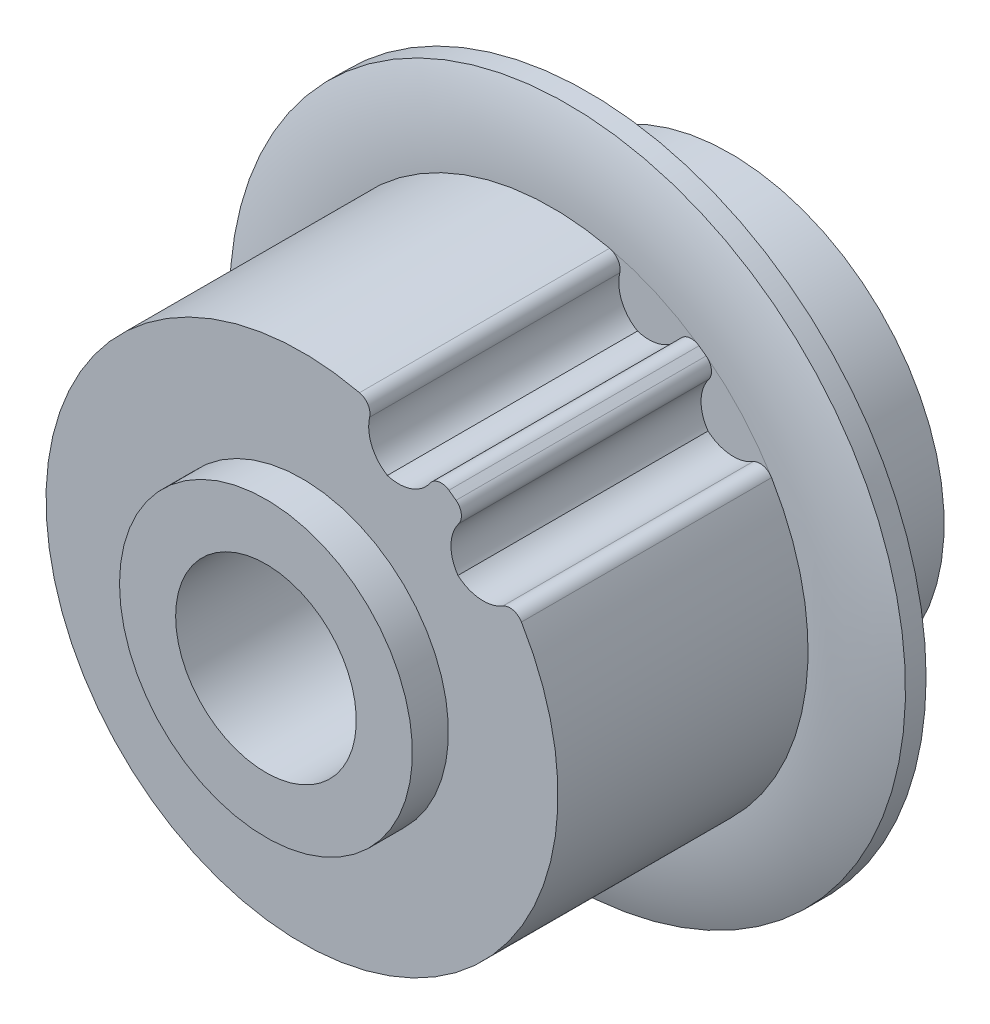
ISO-10303-21;
HEADER;
FILE_DESCRIPTION(('STEP AP214'),'2;1');
FILE_NAME('part.step','',(''),(''),'','','');
FILE_SCHEMA(('AUTOMOTIVE_DESIGN { 1 0 10303 214 1 1 1 1 }'));
ENDSEC;
DATA;
#1=APPLICATION_CONTEXT('core data for automotive mechanical design processes');
#2=APPLICATION_PROTOCOL_DEFINITION('international standard','automotive_design',2000,#1);
#3=PRODUCT_CONTEXT('',#1,'mechanical');
#4=PRODUCT('Part','Part','',(#3));
#5=PRODUCT_RELATED_PRODUCT_CATEGORY('part','',(#4));
#6=PRODUCT_DEFINITION_FORMATION('','',#4);
#7=PRODUCT_DEFINITION_CONTEXT('part definition',#1,'design');
#8=PRODUCT_DEFINITION('design','',#6,#7);
#9=PRODUCT_DEFINITION_SHAPE('','',#8);
#10=(LENGTH_UNIT() NAMED_UNIT(*) SI_UNIT(.MILLI.,.METRE.));
#11=(NAMED_UNIT(*) PLANE_ANGLE_UNIT() SI_UNIT($,.RADIAN.));
#12=(NAMED_UNIT(*) SI_UNIT($,.STERADIAN.) SOLID_ANGLE_UNIT());
#13=UNCERTAINTY_MEASURE_WITH_UNIT(LENGTH_MEASURE(1.E-05),#10,'distance_accuracy_value','');
#14=(GEOMETRIC_REPRESENTATION_CONTEXT(3) GLOBAL_UNCERTAINTY_ASSIGNED_CONTEXT((#13)) GLOBAL_UNIT_ASSIGNED_CONTEXT((#10,
#11,#12)) REPRESENTATION_CONTEXT('',''));
#15=CARTESIAN_POINT('',(0.,0.,0.));
#16=DIRECTION('',(0.,0.,1.));
#17=DIRECTION('',(1.,0.,0.));
#18=AXIS2_PLACEMENT_3D('',#15,#16,#17);
#19=CARTESIAN_POINT('',(-9.69,0.,-9.95));
#20=DIRECTION('',(-1.,0.,0.));
#21=DIRECTION('',(0.,0.,1.));
#22=AXIS2_PLACEMENT_3D('',#19,#20,#21);
#23=CYLINDRICAL_SURFACE('',#22,1.);
#24=CARTESIAN_POINT('',(-9.5,0.,-10.95));
#25=CARTESIAN_POINT('',(-9.49999892870391,0.0559700939608061,-10.9499955022997));
#26=CARTESIAN_POINT('',(-9.49949991902894,0.111986873074257,-10.94528368968));
#27=CARTESIAN_POINT('',(-9.49755527864797,0.222518536683063,-10.9265444379611));
#28=CARTESIAN_POINT('',(-9.49610766287674,0.277030021339668,-10.9124974631074));
#29=CARTESIAN_POINT('',(-9.49242955548284,0.382859598376954,-10.875502986151));
#30=CARTESIAN_POINT('',(-9.49019984820919,0.434180829738746,-10.8525643989129));
#31=CARTESIAN_POINT('',(-9.48520705665351,0.532221152771464,-10.7984545067768));
#32=CARTESIAN_POINT('',(-9.48244420312523,0.578942222297223,-10.7672867614412));
#33=CARTESIAN_POINT('',(-9.47668150333336,0.666671078654715,-10.6974648303014));
#34=CARTESIAN_POINT('',(-9.47368083426394,0.707657540535822,-10.6587839152861));
#35=CARTESIAN_POINT('',(-9.46778735251801,0.78257161431797,-10.5750890419599));
#36=CARTESIAN_POINT('',(-9.46489455023091,0.816498547699888,-10.5300744755932));
#37=CARTESIAN_POINT('',(-9.45953644803475,0.876401748507659,-10.4348614865662));
#38=CARTESIAN_POINT('',(-9.4570721635613,0.902359239575381,-10.3846511887318));
#39=CARTESIAN_POINT('',(-9.45286014633579,0.945466520201204,-10.2805546407822));
#40=CARTESIAN_POINT('',(-9.45111238782538,0.962616626381215,-10.2266685228901));
#41=CARTESIAN_POINT('',(-9.44853861513997,0.987560790152315,-10.1169620532003));
#42=CARTESIAN_POINT('',(-9.44770919717947,0.995389405599358,-10.0611496400934));
#43=CARTESIAN_POINT('',(-9.44705548392416,1.00157520411336,-9.94899729615072));
#44=CARTESIAN_POINT('',(-9.4472311613024,0.999932644686584,-9.89265737969846));
#45=CARTESIAN_POINT('',(-9.44856467676103,0.987251205819851,-9.78128865758294));
#46=CARTESIAN_POINT('',(-9.44971855509934,0.976250208567275,-9.72625548421611));
#47=CARTESIAN_POINT('',(-9.45287229340038,0.945222980929012,-9.61882039299428));
#48=CARTESIAN_POINT('',(-9.45487217354993,0.925196535182412,-9.56641853795969));
#49=CARTESIAN_POINT('',(-9.45949720487386,0.876644469733586,-9.46561314115291));
#50=CARTESIAN_POINT('',(-9.46212360670814,0.848101821073555,-9.41721786096208));
#51=CARTESIAN_POINT('',(-9.46770443570528,0.783342413336238,-9.32589419718302));
#52=CARTESIAN_POINT('',(-9.47065884651236,0.7471260368183,-9.2829655412372));
#53=CARTESIAN_POINT('',(-9.47658007754614,0.667842922786279,-9.20357667259463));
#54=CARTESIAN_POINT('',(-9.47954689086263,0.62474480066102,-9.16714779713866));
#55=CARTESIAN_POINT('',(-9.48514697524511,0.533005846569284,-9.10202007205169));
#56=CARTESIAN_POINT('',(-9.48778009182757,0.484362467099408,-9.07332479578321));
#57=CARTESIAN_POINT('',(-9.49241750088558,0.38287414624455,-9.02448191177889));
#58=CARTESIAN_POINT('',(-9.49442114831984,0.33002496404566,-9.00434306474903));
#59=CARTESIAN_POINT('',(-9.49756499373266,0.221756188152259,-8.97327882580456));
#60=CARTESIAN_POINT('',(-9.49870702191246,0.166342309677429,-8.96233389905823));
#61=CARTESIAN_POINT('',(-9.49978500834582,0.073775403527102,-8.95203987006847));
#62=CARTESIAN_POINT('',(-9.50000070624356,0.0368978464529327,-8.94999703492627));
#63=CARTESIAN_POINT('',(-9.49999892870391,-0.0559700939608068,-8.9500044977003));
#64=CARTESIAN_POINT('',(-9.49949991902894,-0.111986873074257,-8.95471631031997));
#65=CARTESIAN_POINT('',(-9.49755527864797,-0.222518536683064,-8.97345556203892));
#66=CARTESIAN_POINT('',(-9.49610766287674,-0.277030021339668,-8.98750253689262));
#67=CARTESIAN_POINT('',(-9.49242955548284,-0.382859598376955,-9.02449701384902));
#68=CARTESIAN_POINT('',(-9.49019984820919,-0.434180829738747,-9.04743560108709));
#69=CARTESIAN_POINT('',(-9.48520705665351,-0.532221152771464,-9.1015454932232));
#70=CARTESIAN_POINT('',(-9.48244420312523,-0.578942222297223,-9.13271323855881));
#71=CARTESIAN_POINT('',(-9.47668150333336,-0.666671078654715,-9.2025351696986));
#72=CARTESIAN_POINT('',(-9.47368083426394,-0.707657540535822,-9.24121608471389));
#73=CARTESIAN_POINT('',(-9.46778735251801,-0.78257161431797,-9.32491095804006));
#74=CARTESIAN_POINT('',(-9.46489455023091,-0.816498547699888,-9.36992552440684));
#75=CARTESIAN_POINT('',(-9.45953644803475,-0.876401748507659,-9.46513851343379));
#76=CARTESIAN_POINT('',(-9.4570721635613,-0.902359239575381,-9.51534881126819));
#77=CARTESIAN_POINT('',(-9.45286014633579,-0.945466520201204,-9.61944535921782));
#78=CARTESIAN_POINT('',(-9.45111238782538,-0.962616626381215,-9.67333147710991));
#79=CARTESIAN_POINT('',(-9.44853861513997,-0.987560790152315,-9.78303794679972));
#80=CARTESIAN_POINT('',(-9.44770919717947,-0.995389405599358,-9.83885035990659));
#81=CARTESIAN_POINT('',(-9.44705548392416,-1.00157520411336,-9.95100270384928));
#82=CARTESIAN_POINT('',(-9.4472311613024,-0.999932644686584,-10.0073426203015));
#83=CARTESIAN_POINT('',(-9.44856467676103,-0.987251205819851,-10.1187113424171));
#84=CARTESIAN_POINT('',(-9.44971855509934,-0.976250208567275,-10.1737445157839));
#85=CARTESIAN_POINT('',(-9.45287229340038,-0.945222980929012,-10.2811796070057));
#86=CARTESIAN_POINT('',(-9.45487217354993,-0.925196535182412,-10.3335814620403));
#87=CARTESIAN_POINT('',(-9.45949720487386,-0.876644469733586,-10.4343868588471));
#88=CARTESIAN_POINT('',(-9.46212360670814,-0.848101821073556,-10.4827821390379));
#89=CARTESIAN_POINT('',(-9.46770443570528,-0.783342413336238,-10.574105802817));
#90=CARTESIAN_POINT('',(-9.47065884651236,-0.7471260368183,-10.6170344587628));
#91=CARTESIAN_POINT('',(-9.47658007754614,-0.667842922786279,-10.6964233274054));
#92=CARTESIAN_POINT('',(-9.47954689086263,-0.62474480066102,-10.7328522028613));
#93=CARTESIAN_POINT('',(-9.48514697524511,-0.533005846569284,-10.7979799279483));
#94=CARTESIAN_POINT('',(-9.48778009182757,-0.484362467099408,-10.8266752042168));
#95=CARTESIAN_POINT('',(-9.49241750088558,-0.38287414624455,-10.8755180882211));
#96=CARTESIAN_POINT('',(-9.49442114831984,-0.330024964045659,-10.895656935251));
#97=CARTESIAN_POINT('',(-9.49756499373266,-0.221756188152259,-10.9267211741954));
#98=CARTESIAN_POINT('',(-9.49870702191246,-0.166342309677428,-10.9376661009418));
#99=CARTESIAN_POINT('',(-9.49978500834582,-0.0737754035271021,-10.9479601299315));
#100=CARTESIAN_POINT('',(-9.50000070624356,-0.0368978464529331,-10.9500029650737));
#101=CARTESIAN_POINT('',(-9.5,0.,-10.95));
#102=B_SPLINE_CURVE_WITH_KNOTS('',3,(#24,#25,#26,#27,#28,#29,#30,#31,#32,#33,#34,#35,#36,#37,
#38,#39,#40,#41,#42,#43,#44,#45,#46,#47,#48,#49,#50,#51,#52,#53,#54,#55,#56,#57,#58,#59,#60,#61,
#62,#63,#64,#65,#66,#67,#68,#69,#70,#71,#72,#73,#74,#75,#76,#77,#78,#79,#80,#81,#82,#83,#84,#85,
#86,#87,#88,#89,#90,#91,#92,#93,#94,#95,#96,#97,#98,#99,#100,#101),.UNSPECIFIED.,.T.,.F.,(4,2,2,
2,2,2,2,2,2,2,2,2,2,2,2,2,2,2,2,2,2,2,2,2,2,2,2,2,2,2,2,2,2,2,2,2,2,2,4),(0.,0.167792693719711,
0.335937638702718,0.503914433271829,0.671818687359583,0.840331604267453,1.00886071014262,
1.17778388379038,1.34670098429351,1.51498988367949,1.68327420757795,1.85088055416382,
2.01849090030355,2.18643867137875,2.3543780717011,2.52310647594285,2.691912709156,
2.86089136460136,3.02951006699616,3.14012608727887,3.30791878099858,3.47606372598159,
3.6440405205507,3.81194477463845,3.98045769154632,4.14898679742148,4.31790997106925,
4.48682707157238,4.65511597095835,4.82340029485682,4.99100664144269,5.15861698758242,
5.32656475865761,5.49450415897996,5.66323256322172,5.83203879643487,6.00101745188023,
6.16963615427503,6.28025217455774),.UNSPECIFIED.);
#103=CARTESIAN_POINT('',(-9.5,0.,-10.95));
#104=VERTEX_POINT('',#103);
#105=EDGE_CURVE('E132',#104,#104,#102,.T.);
#106=ORIENTED_EDGE('',*,*,#105,.F.);
#107=EDGE_LOOP('',(#106));
#108=FACE_BOUND('',#107,.T.);
#109=CARTESIAN_POINT('',(-4.00899999981644,-3.83635298694221E-05,-8.95000000073588));
#110=CARTESIAN_POINT('',(-4.00899783715485,-0.0552293567423015,-8.95000493874078));
#111=CARTESIAN_POINT('',(-4.00784657338917,-0.110485109786371,-8.95459353594478));
#112=CARTESIAN_POINT('',(-4.0033617579206,-0.219462030811974,-8.97281048034207));
#113=CARTESIAN_POINT('',(-4.00002409504494,-0.273180108443522,-8.98645585799812));
#114=CARTESIAN_POINT('',(-3.99153677468544,-0.377418749122957,-9.02232201321078));
#115=CARTESIAN_POINT('',(-3.98639021795785,-0.427944610423024,-9.04452812246428));
#116=CARTESIAN_POINT('',(-3.97483469983699,-0.524537308783836,-9.09684224257587));
#117=CARTESIAN_POINT('',(-3.96842606598316,-0.570605298153424,-9.12694820390426));
#118=CARTESIAN_POINT('',(-3.95489338257512,-0.657944114077941,-9.19486696509711));
#119=CARTESIAN_POINT('',(-3.94775827540494,-0.699110211696236,-9.23281225529305));
#120=CARTESIAN_POINT('',(-3.93365015110532,-0.774567235090252,-9.31505062775436));
#121=CARTESIAN_POINT('',(-3.92667716125479,-0.808857011108918,-9.35934476946144));
#122=CARTESIAN_POINT('',(-3.91357265682953,-0.870073332175735,-9.45382794149136));
#123=CARTESIAN_POINT('',(-3.90745507532849,-0.896883775390726,-9.50409430330711));
#124=CARTESIAN_POINT('',(-3.89691410697441,-0.941633472202699,-9.60859741479397));
#125=CARTESIAN_POINT('',(-3.89249043743761,-0.959574206141919,-9.66283350018783));
#126=CARTESIAN_POINT('',(-3.88595101723692,-0.985720768263759,-9.77259276027769));
#127=CARTESIAN_POINT('',(-3.88379098499138,-0.994113664108168,-9.82806867268855));
#128=CARTESIAN_POINT('',(-3.88189085459983,-1.00150894116826,-9.93967998462077));
#129=CARTESIAN_POINT('',(-3.88215036764057,-1.0005128311672,-9.99581527673393));
#130=CARTESIAN_POINT('',(-3.88502018325709,-0.989307702476693,-10.1057188666996));
#131=CARTESIAN_POINT('',(-3.88757362908199,-0.979321497188372,-10.1595115976952));
#132=CARTESIAN_POINT('',(-3.89465304460067,-0.95077487458606,-10.2646334163648));
#133=CARTESIAN_POINT('',(-3.89917916731603,-0.932213792107592,-10.3159623125748));
#134=CARTESIAN_POINT('',(-3.90974640949498,-0.886853367969224,-10.4152987641752));
#135=CARTESIAN_POINT('',(-3.9158023542757,-0.859972793070105,-10.463267582164));
#136=CARTESIAN_POINT('',(-3.92873797017951,-0.79879515328098,-10.5540904179203));
#137=CARTESIAN_POINT('',(-3.93561772963354,-0.764497292777454,-10.5969438862251));
#138=CARTESIAN_POINT('',(-3.94966445523883,-0.688310283964731,-10.6775933117669));
#139=CARTESIAN_POINT('',(-3.95683404853103,-0.646234278728623,-10.7152124922289));
#140=CARTESIAN_POINT('',(-3.97048066418085,-0.556265385569994,-10.782909704959));
#141=CARTESIAN_POINT('',(-3.97695738789233,-0.508370008180557,-10.8129844928347));
#142=CARTESIAN_POINT('',(-3.98852136129807,-0.407857220870324,-10.8648028205827));
#143=CARTESIAN_POINT('',(-3.99360272163466,-0.355221004952954,-10.8865111994679));
#144=CARTESIAN_POINT('',(-4.00175264150562,-0.24695561283743,-10.9206813343659));
#145=CARTESIAN_POINT('',(-4.00482539255561,-0.1913329330723,-10.9331623529837));
#146=CARTESIAN_POINT('',(-4.00747866585569,-0.112705807074774,-10.9438863139757));
#147=CARTESIAN_POINT('',(-4.00804790924419,-0.0902269245865095,-10.9461773183999));
#148=CARTESIAN_POINT('',(-4.00880899476839,-0.0451591182652935,-10.9492350749165));
#149=CARTESIAN_POINT('',(-4.00900083601612,-0.0225701941735531,-10.9500018234225));
#150=CARTESIAN_POINT('',(-4.00899795798884,0.0552205504316248,-10.949995545512));
#151=CARTESIAN_POINT('',(-4.00784681650635,0.110476312754407,-10.9454074386454));
#152=CARTESIAN_POINT('',(-4.00336223488077,0.219453343707925,-10.9271914694809));
#153=CARTESIAN_POINT('',(-4.00002468320584,0.273171521890136,-10.9135465753064));
#154=CARTESIAN_POINT('',(-3.99153756179438,0.377410442477614,-10.8776813648257));
#155=CARTESIAN_POINT('',(-3.9863910929306,0.427936483127292,-10.8554757172222));
#156=CARTESIAN_POINT('',(-3.97483571817119,0.524529610929208,-10.80316248862));
#157=CARTESIAN_POINT('',(-3.96842713987295,0.570597850545521,-10.773056957469));
#158=CARTESIAN_POINT('',(-3.95489453074374,0.657937230811791,-10.7051390293912));
#159=CARTESIAN_POINT('',(-3.94775944167969,0.699103644773704,-10.6671941426468));
#160=CARTESIAN_POINT('',(-3.93365131002145,0.774561366551442,-10.5849565274355));
#161=CARTESIAN_POINT('',(-3.92667829470117,0.808851524524785,-10.5406627394299));
#162=CARTESIAN_POINT('',(-3.91357369007897,0.870068700726665,-10.4461801798255));
#163=CARTESIAN_POINT('',(-3.90745603400351,0.896879611395164,-10.3959140714264));
#164=CARTESIAN_POINT('',(-3.89691488088153,0.941630281500125,-10.2914113848947));
#165=CARTESIAN_POINT('',(-3.89249110116544,0.959571521229262,-10.2371754710336));
#166=CARTESIAN_POINT('',(-3.88595143747999,0.985719118813236,-10.1274164171638));
#167=CARTESIAN_POINT('',(-3.88379127405755,0.994112536782719,-10.0719405394734));
#168=CARTESIAN_POINT('',(-3.8818908789198,1.00150884899567,-9.96032920369465));
#169=CARTESIAN_POINT('',(-3.88215025837835,1.00051325207526,-9.90419385303316));
#170=CARTESIAN_POINT('',(-3.88501982318614,0.989309113586772,-9.79429009231826));
#171=CARTESIAN_POINT('',(-3.88757315010191,0.979323391340706,-9.74049725064723));
#172=CARTESIAN_POINT('',(-3.89465235182896,0.950777704978313,-9.63537513312852));
#173=CARTESIAN_POINT('',(-3.89917837965076,0.932217075751482,-9.58404604872254));
#174=CARTESIAN_POINT('',(-3.90974545928263,0.886857544700806,-9.48470920046318));
#175=CARTESIAN_POINT('',(-3.91580133527205,0.859977417312322,-9.43674016947325));
#176=CARTESIAN_POINT('',(-3.92873685166647,0.798800637615128,-9.34591683722279));
#177=CARTESIAN_POINT('',(-3.93561658041334,0.764503189627557,-9.30306308546005));
#178=CARTESIAN_POINT('',(-3.94966328658145,0.688316967604519,-9.22241301352358));
#179=CARTESIAN_POINT('',(-3.95683289233705,0.646241334383191,-9.18479346923408));
#180=CARTESIAN_POINT('',(-3.97047957550749,0.556273128803601,-9.11709546904037));
#181=CARTESIAN_POINT('',(-3.97695635431693,0.508378067139802,-9.08702025725957));
#182=CARTESIAN_POINT('',(-3.98852048194124,0.407865792381285,-9.03520100034339));
#183=CARTESIAN_POINT('',(-3.99360194019151,0.3552297686289,-9.01349212412273));
#184=CARTESIAN_POINT('',(-4.00175208105518,0.246964665784147,-8.97932096755349));
#185=CARTESIAN_POINT('',(-4.00482495480801,0.191342082801663,-8.96683942614396));
#186=CARTESIAN_POINT('',(-4.00747850691793,0.112712049232022,-8.95611432536784));
#187=CARTESIAN_POINT('',(-4.00804785279228,0.0902301817230549,-8.95382290842575));
#188=CARTESIAN_POINT('',(-4.00880904253085,0.0451563756716324,-8.95076473316889));
#189=CARTESIAN_POINT('',(-4.00900088550821,0.0225644368707127,-8.949997978436));
#190=CARTESIAN_POINT('',(-4.00899999981644,-3.83635298694221E-05,-8.95000000073588));
#191=B_SPLINE_CURVE_WITH_KNOTS('',3,(#109,#110,#111,#112,#113,#114,#115,#116,#117,#118,#119,
#120,#121,#122,#123,#124,#125,#126,#127,#128,#129,#130,#131,#132,#133,#134,#135,#136,#137,#138,
#139,#140,#141,#142,#143,#144,#145,#146,#147,#148,#149,#150,#151,#152,#153,#154,#155,#156,#157,
#158,#159,#160,#161,#162,#163,#164,#165,#166,#167,#168,#169,#170,#171,#172,#173,#174,#175,#176,
#177,#178,#179,#180,#181,#182,#183,#184,#185,#186,#187,#188,#189,#190),.UNSPECIFIED.,.T.,.F.,(4,
2,2,2,2,2,2,2,2,2,2,2,2,2,2,2,2,2,2,2,2,2,2,2,2,2,2,2,2,2,2,2,2,2,2,2,2,2,2,2,4),(0.,
0.165486316353608,0.331284699839844,0.49680025134277,0.662272904040501,0.830812262673603,
0.999379778518091,1.17043434970166,1.34146036246759,1.50907446792837,1.67666163879701,
1.840206271743,2.00376359319152,2.16897118456502,2.33419650569204,2.50408286455722,
2.67404215662728,2.84470813341029,3.0150168220486,3.08278055286827,3.1505444431271,
3.31603065138589,3.48182895228629,3.64734441436066,3.8128169711717,3.98135620285448,
4.14992359408572,4.3209781795018,4.49200420733051,4.6596184578163,4.82720577276853,
4.99075044947191,5.15430781360733,5.31951528470037,5.48474048690697,5.65462674838026,
5.82458593755983,5.99525197459394,6.1655607510437,6.2333335011333,6.30110641044064),.UNSPECIFIED.);
#192=CARTESIAN_POINT('',(-4.00899999981644,-3.83635298694221E-05,-8.95000000073588));
#193=VERTEX_POINT('',#192);
#194=EDGE_CURVE('E101',#193,#193,#191,.T.);
#195=ORIENTED_EDGE('',*,*,#194,.T.);
#196=EDGE_LOOP('',(#195));
#197=FACE_BOUND('',#196,.T.);
#198=ADVANCED_FACE('F16',(#108,#197),#23,.F.);
#199=CARTESIAN_POINT('',(0.,0.,-13.45));
#200=DIRECTION('',(0.,0.,-1.));
#201=DIRECTION('',(-1.,0.,0.));
#202=AXIS2_PLACEMENT_3D('',#199,#200,#201);
#203=PLANE('',#202);
#204=CARTESIAN_POINT('',(0.,0.,-13.45));
#205=DIRECTION('',(0.,0.,-1.));
#206=DIRECTION('',(-1.,0.,0.));
#207=AXIS2_PLACEMENT_3D('',#204,#205,#206);
#208=CIRCLE('',#207,4.009);
#209=CARTESIAN_POINT('',(-4.009,0.,-13.45));
#210=VERTEX_POINT('',#209);
#211=EDGE_CURVE('E138',#210,#210,#208,.F.);
#212=ORIENTED_EDGE('',*,*,#211,.T.);
#213=EDGE_LOOP('',(#212));
#214=FACE_BOUND('',#213,.T.);
#215=CARTESIAN_POINT('',(0.,0.,-13.45));
#216=DIRECTION('',(0.,0.,-1.));
#217=DIRECTION('',(-1.,0.,0.));
#218=AXIS2_PLACEMENT_3D('',#215,#216,#217);
#219=CIRCLE('',#218,9.5);
#220=CARTESIAN_POINT('',(-9.5,0.,-13.45));
#221=VERTEX_POINT('',#220);
#222=EDGE_CURVE('E129',#221,#221,#219,.F.);
#223=ORIENTED_EDGE('',*,*,#222,.F.);
#224=EDGE_LOOP('',(#223));
#225=FACE_BOUND('',#224,.T.);
#226=ADVANCED_FACE('F160',(#214,#225),#203,.T.);
#227=CARTESIAN_POINT('',(0.,0.,8.18));
#228=DIRECTION('',(0.,0.,-1.));
#229=DIRECTION('',(-1.,0.,0.));
#230=AXIS2_PLACEMENT_3D('',#227,#228,#229);
#231=CYLINDRICAL_SURFACE('',#230,11.3625);
#232=CARTESIAN_POINT('',(0.,0.,5.55));
#233=DIRECTION('',(0.,0.,-1.));
#234=DIRECTION('',(-1.,0.,0.));
#235=AXIS2_PLACEMENT_3D('',#232,#233,#234);
#236=CIRCLE('',#235,11.3625);
#237=CARTESIAN_POINT('',(6.51940660981192,9.30611324377365,5.55));
#238=VERTEX_POINT('',#237);
#239=CARTESIAN_POINT('',(6.83603220620295,9.07607128254069,5.55));
#240=VERTEX_POINT('',#239);
#241=EDGE_CURVE('E20',#238,#240,#236,.T.);
#242=ORIENTED_EDGE('',*,*,#241,.T.);
#243=DIRECTION('',(0.,0.,1.));
#244=VECTOR('',#243,1.);
#245=CARTESIAN_POINT('',(6.83603220620619,9.07607128253825,5.55));
#246=LINE('',#245,#244);
#247=CARTESIAN_POINT('',(6.83603220620493,9.07607128253897,-5.55));
#248=VERTEX_POINT('',#247);
#249=EDGE_CURVE('E116',#248,#240,#246,.T.);
#250=ORIENTED_EDGE('',*,*,#249,.F.);
#251=CARTESIAN_POINT('',(0.,0.,-5.55));
#252=DIRECTION('',(0.,0.,-1.));
#253=DIRECTION('',(-1.,0.,0.));
#254=AXIS2_PLACEMENT_3D('',#251,#252,#253);
#255=CIRCLE('',#254,11.3625);
#256=CARTESIAN_POINT('',(6.51940661070273,9.30611324314981,-5.55));
#257=VERTEX_POINT('',#256);
#258=EDGE_CURVE('E102',#248,#257,#255,.F.);
#259=ORIENTED_EDGE('',*,*,#258,.T.);
#260=DIRECTION('',(0.,0.,1.));
#261=VECTOR('',#260,1.);
#262=CARTESIAN_POINT('',(6.51940660981177,9.30611324377368,5.55));
#263=LINE('',#262,#261);
#264=EDGE_CURVE('E105',#238,#257,#263,.F.);
#265=ORIENTED_EDGE('',*,*,#264,.F.);
#266=EDGE_LOOP('',(#242,#250,#259,#265));
#267=FACE_BOUND('',#266,.T.);
#268=ADVANCED_FACE('F106',(#267),#231,.T.);
#269=CARTESIAN_POINT('',(0.,0.,8.18));
#270=DIRECTION('',(0.,0.,-1.));
#271=DIRECTION('',(-1.,0.,0.));
#272=AXIS2_PLACEMENT_3D('',#269,#270,#271);
#273=CYLINDRICAL_SURFACE('',#272,4.009);
#274=ORIENTED_EDGE('',*,*,#211,.F.);
#275=EDGE_LOOP('',(#274));
#276=FACE_BOUND('',#275,.T.);
#277=CARTESIAN_POINT('',(0.,0.,7.15));
#278=DIRECTION('',(0.,0.,-1.));
#279=DIRECTION('',(-1.,0.,0.));
#280=AXIS2_PLACEMENT_3D('',#277,#278,#279);
#281=CIRCLE('',#280,4.009);
#282=CARTESIAN_POINT('',(-4.009,0.,7.15));
#283=VERTEX_POINT('',#282);
#284=EDGE_CURVE('E108',#283,#283,#281,.F.);
#285=ORIENTED_EDGE('',*,*,#284,.T.);
#286=EDGE_LOOP('',(#285));
#287=FACE_BOUND('',#286,.T.);
#288=ORIENTED_EDGE('',*,*,#194,.F.);
#289=EDGE_LOOP('',(#288));
#290=FACE_BOUND('',#289,.T.);
#291=ADVANCED_FACE('F145',(#276,#287,#290),#273,.F.);
#292=CARTESIAN_POINT('',(0.,0.,8.18));
#293=DIRECTION('',(0.,0.,-1.));
#294=DIRECTION('',(-1.,0.,0.));
#295=AXIS2_PLACEMENT_3D('',#292,#293,#294);
#296=CYLINDRICAL_SURFACE('',#295,9.5);
#297=CARTESIAN_POINT('',(0.,0.,-7.15));
#298=DIRECTION('',(0.,0.,-1.));
#299=DIRECTION('',(-1.,0.,0.));
#300=AXIS2_PLACEMENT_3D('',#297,#298,#299);
#301=CIRCLE('',#300,9.5);
#302=CARTESIAN_POINT('',(-9.5,0.,-7.15));
#303=VERTEX_POINT('',#302);
#304=EDGE_CURVE('E167',#303,#303,#301,.F.);
#305=ORIENTED_EDGE('',*,*,#304,.F.);
#306=EDGE_LOOP('',(#305));
#307=FACE_BOUND('',#306,.T.);
#308=ORIENTED_EDGE('',*,*,#222,.T.);
#309=EDGE_LOOP('',(#308));
#310=FACE_BOUND('',#309,.T.);
#311=ORIENTED_EDGE('',*,*,#105,.T.);
#312=EDGE_LOOP('',(#311));
#313=FACE_BOUND('',#312,.T.);
#314=ADVANCED_FACE('F139',(#307,#310,#313),#296,.T.);
#315=CARTESIAN_POINT('',(6.475390521211,8.5972541059,5.55));
#316=DIRECTION('',(0.,0.,1.));
#317=DIRECTION('',(1.,0.,0.));
#318=AXIS2_PLACEMENT_3D('',#315,#316,#317);
#319=CYLINDRICAL_SURFACE('',#318,0.59944);
#320=CARTESIAN_POINT('',(6.475390521211,8.5972541059,-5.55));
#321=DIRECTION('',(0.,0.,1.));
#322=DIRECTION('',(1.,0.,0.));
#323=AXIS2_PLACEMENT_3D('',#320,#321,#322);
#324=CIRCLE('',#323,0.59944);
#325=CARTESIAN_POINT('',(6.95386365701467,8.23615609716265,-5.55));
#326=VERTEX_POINT('',#325);
#327=EDGE_CURVE('E123',#326,#248,#324,.T.);
#328=ORIENTED_EDGE('',*,*,#327,.T.);
#329=ORIENTED_EDGE('',*,*,#249,.T.);
#330=CARTESIAN_POINT('',(6.475390521211,8.5972541059,5.55));
#331=DIRECTION('',(0.,0.,1.));
#332=DIRECTION('',(1.,0.,0.));
#333=AXIS2_PLACEMENT_3D('',#330,#331,#332);
#334=CIRCLE('',#333,0.59944);
#335=CARTESIAN_POINT('',(6.95386365701467,8.23615609716265,5.55));
#336=VERTEX_POINT('',#335);
#337=EDGE_CURVE('E97',#240,#336,#334,.F.);
#338=ORIENTED_EDGE('',*,*,#337,.T.);
#339=DIRECTION('',(0.,0.,1.));
#340=VECTOR('',#339,1.);
#341=CARTESIAN_POINT('',(6.95386365701451,8.23615609716262,5.55));
#342=LINE('',#341,#340);
#343=EDGE_CURVE('E169',#336,#326,#342,.F.);
#344=ORIENTED_EDGE('',*,*,#343,.T.);
#345=EDGE_LOOP('',(#328,#329,#338,#344));
#346=FACE_BOUND('',#345,.T.);
#347=ADVANCED_FACE('F144',(#346),#319,.T.);
#348=CARTESIAN_POINT('',(6.175468823393,8.815159974436,5.55));
#349=DIRECTION('',(0.,0.,1.));
#350=DIRECTION('',(1.,0.,0.));
#351=AXIS2_PLACEMENT_3D('',#348,#349,#350);
#352=CYLINDRICAL_SURFACE('',#351,0.59944);
#353=CARTESIAN_POINT('',(6.175468823393,8.815159974436,5.55));
#354=DIRECTION('',(0.,0.,1.));
#355=DIRECTION('',(1.,0.,0.));
#356=AXIS2_PLACEMENT_3D('',#353,#354,#355);
#357=CIRCLE('',#356,0.59944);
#358=CARTESIAN_POINT('',(5.68418787884729,9.15862954677945,5.55));
#359=VERTEX_POINT('',#358);
#360=EDGE_CURVE('E94',#359,#238,#357,.F.);
#361=ORIENTED_EDGE('',*,*,#360,.T.);
#362=ORIENTED_EDGE('',*,*,#264,.T.);
#363=CARTESIAN_POINT('',(6.175468823393,8.815159974436,-5.55));
#364=DIRECTION('',(0.,0.,1.));
#365=DIRECTION('',(1.,0.,0.));
#366=AXIS2_PLACEMENT_3D('',#363,#364,#365);
#367=CIRCLE('',#366,0.59944);
#368=CARTESIAN_POINT('',(5.68418787884729,9.15862954677945,-5.55));
#369=VERTEX_POINT('',#368);
#370=EDGE_CURVE('E114',#257,#369,#367,.T.);
#371=ORIENTED_EDGE('',*,*,#370,.T.);
#372=DIRECTION('',(0.,0.,1.));
#373=VECTOR('',#372,1.);
#374=CARTESIAN_POINT('',(5.68418787884778,9.15862954677946,5.55));
#375=LINE('',#374,#373);
#376=EDGE_CURVE('E112',#369,#359,#375,.T.);
#377=ORIENTED_EDGE('',*,*,#376,.T.);
#378=EDGE_LOOP('',(#361,#362,#371,#377));
#379=FACE_BOUND('',#378,.T.);
#380=ADVANCED_FACE('F110',(#379),#352,.T.);
#381=CARTESIAN_POINT('',(0.,0.,7.15));
#382=DIRECTION('',(0.,0.,-1.));
#383=DIRECTION('',(-1.,0.,0.));
#384=AXIS2_PLACEMENT_3D('',#381,#382,#383);
#385=PLANE('',#384);
#386=ORIENTED_EDGE('',*,*,#284,.F.);
#387=EDGE_LOOP('',(#386));
#388=FACE_BOUND('',#387,.T.);
#389=CARTESIAN_POINT('',(0.,0.,7.15));
#390=DIRECTION('',(0.,0.,-1.));
#391=DIRECTION('',(-1.,0.,0.));
#392=AXIS2_PLACEMENT_3D('',#389,#390,#391);
#393=CIRCLE('',#392,6.5);
#394=CARTESIAN_POINT('',(-6.5,0.,7.15));
#395=VERTEX_POINT('',#394);
#396=EDGE_CURVE('E175',#395,#395,#393,.T.);
#397=ORIENTED_EDGE('',*,*,#396,.F.);
#398=EDGE_LOOP('',(#397));
#399=FACE_BOUND('',#398,.T.);
#400=ADVANCED_FACE('F347',(#388,#399),#385,.F.);
#401=CARTESIAN_POINT('',(0.,0.,-7.15));
#402=DIRECTION('',(0.,0.,-1.));
#403=DIRECTION('',(-1.,0.,0.));
#404=AXIS2_PLACEMENT_3D('',#401,#402,#403);
#405=PLANE('',#404);
#406=ORIENTED_EDGE('',*,*,#304,.T.);
#407=EDGE_LOOP('',(#406));
#408=FACE_BOUND('',#407,.T.);
#409=CARTESIAN_POINT('',(0.,0.,-7.15));
#410=DIRECTION('',(0.,0.,-1.));
#411=DIRECTION('',(-1.,0.,0.));
#412=AXIS2_PLACEMENT_3D('',#409,#410,#411);
#413=CIRCLE('',#412,15.);
#414=CARTESIAN_POINT('',(-15.,0.,-7.15));
#415=VERTEX_POINT('',#414);
#416=EDGE_CURVE('E179',#415,#415,#413,.F.);
#417=ORIENTED_EDGE('',*,*,#416,.F.);
#418=EDGE_LOOP('',(#417));
#419=FACE_BOUND('',#418,.T.);
#420=ADVANCED_FACE('F419',(#408,#419),#405,.T.);
#421=CARTESIAN_POINT('',(8.310213351306,7.212535046971,5.55));
#422=DIRECTION('',(0.,0.,1.));
#423=DIRECTION('',(1.,0.,0.));
#424=AXIS2_PLACEMENT_3D('',#421,#422,#423);
#425=CYLINDRICAL_SURFACE('',#424,1.69926);
#426=CARTESIAN_POINT('',(8.310213351306,7.212535046971,-5.55));
#427=DIRECTION('',(0.,0.,1.));
#428=DIRECTION('',(1.,0.,0.));
#429=AXIS2_PLACEMENT_3D('',#426,#427,#428);
#430=CIRCLE('',#429,1.69926);
#431=CARTESIAN_POINT('',(6.92198474820684,6.23258306185219,-5.55));
#432=VERTEX_POINT('',#431);
#433=EDGE_CURVE('E188',#326,#432,#430,.T.);
#434=ORIENTED_EDGE('',*,*,#433,.F.);
#435=ORIENTED_EDGE('',*,*,#343,.F.);
#436=CARTESIAN_POINT('',(8.310213351306,7.212535046971,5.55));
#437=DIRECTION('',(0.,0.,1.));
#438=DIRECTION('',(1.,0.,0.));
#439=AXIS2_PLACEMENT_3D('',#436,#437,#438);
#440=CIRCLE('',#439,1.69926);
#441=CARTESIAN_POINT('',(6.92198474820684,6.23258306185219,5.55));
#442=VERTEX_POINT('',#441);
#443=EDGE_CURVE('E199',#336,#442,#440,.T.);
#444=ORIENTED_EDGE('',*,*,#443,.T.);
#445=DIRECTION('',(0.,0.,1.));
#446=VECTOR('',#445,1.);
#447=CARTESIAN_POINT('',(6.92198474820597,6.23258306185296,5.55));
#448=LINE('',#447,#446);
#449=EDGE_CURVE('E195',#442,#432,#448,.F.);
#450=ORIENTED_EDGE('',*,*,#449,.T.);
#451=EDGE_LOOP('',(#434,#435,#444,#450));
#452=FACE_BOUND('',#451,.T.);
#453=ADVANCED_FACE('F340',(#452),#425,.F.);
#454=CARTESIAN_POINT('',(4.291531302994,10.1322784616,5.55));
#455=DIRECTION('',(0.,0.,1.));
#456=DIRECTION('',(1.,0.,0.));
#457=AXIS2_PLACEMENT_3D('',#454,#455,#456);
#458=CYLINDRICAL_SURFACE('',#457,1.69926);
#459=CARTESIAN_POINT('',(4.291531302994,10.1322784616,-5.55));
#460=DIRECTION('',(0.,0.,1.));
#461=DIRECTION('',(1.,0.,0.));
#462=AXIS2_PLACEMENT_3D('',#459,#460,#461);
#463=CIRCLE('',#462,1.69926);
#464=CARTESIAN_POINT('',(3.78852781232821,8.50917278544206,-5.55));
#465=VERTEX_POINT('',#464);
#466=EDGE_CURVE('E185',#465,#369,#463,.T.);
#467=ORIENTED_EDGE('',*,*,#466,.F.);
#468=DIRECTION('',(0.,0.,1.));
#469=VECTOR('',#468,1.);
#470=CARTESIAN_POINT('',(3.78852781232616,8.50917278544328,5.55));
#471=LINE('',#470,#469);
#472=CARTESIAN_POINT('',(3.78852781232821,8.50917278544206,5.55));
#473=VERTEX_POINT('',#472);
#474=EDGE_CURVE('E178',#465,#473,#471,.T.);
#475=ORIENTED_EDGE('',*,*,#474,.T.);
#476=CARTESIAN_POINT('',(4.291531302994,10.1322784616,5.55));
#477=DIRECTION('',(0.,0.,1.));
#478=DIRECTION('',(1.,0.,0.));
#479=AXIS2_PLACEMENT_3D('',#476,#477,#478);
#480=CIRCLE('',#479,1.69926);
#481=EDGE_CURVE('E206',#473,#359,#480,.T.);
#482=ORIENTED_EDGE('',*,*,#481,.T.);
#483=ORIENTED_EDGE('',*,*,#376,.F.);
#484=EDGE_LOOP('',(#467,#475,#482,#483));
#485=FACE_BOUND('',#484,.T.);
#486=ADVANCED_FACE('F404',(#485),#458,.F.);
#487=CARTESIAN_POINT('',(0.,0.,8.18));
#488=DIRECTION('',(0.,0.,-1.));
#489=DIRECTION('',(-1.,0.,0.));
#490=AXIS2_PLACEMENT_3D('',#487,#488,#489);
#491=CYLINDRICAL_SURFACE('',#490,6.5);
#492=ORIENTED_EDGE('',*,*,#396,.T.);
#493=EDGE_LOOP('',(#492));
#494=FACE_BOUND('',#493,.T.);
#495=CARTESIAN_POINT('',(0.,0.,5.55));
#496=DIRECTION('',(0.,0.,-1.));
#497=DIRECTION('',(-1.,0.,0.));
#498=AXIS2_PLACEMENT_3D('',#495,#496,#497);
#499=CIRCLE('',#498,6.5);
#500=CARTESIAN_POINT('',(-6.5,0.,5.55));
#501=VERTEX_POINT('',#500);
#502=EDGE_CURVE('E208',#501,#501,#499,.F.);
#503=ORIENTED_EDGE('',*,*,#502,.T.);
#504=EDGE_LOOP('',(#503));
#505=FACE_BOUND('',#504,.T.);
#506=ADVANCED_FACE('F397',(#494,#505),#491,.T.);
#507=CARTESIAN_POINT('',(4.658155366055,9.969046912002,5.55));
#508=DIRECTION('',(0.,0.,1.));
#509=DIRECTION('',(1.,0.,0.));
#510=AXIS2_PLACEMENT_3D('',#507,#508,#509);
#511=CYLINDRICAL_SURFACE('',#510,1.69926);
#512=CARTESIAN_POINT('',(4.658155366055,9.969046912002,-5.55));
#513=DIRECTION('',(0.,0.,1.));
#514=DIRECTION('',(1.,0.,0.));
#515=AXIS2_PLACEMENT_3D('',#512,#513,#514);
#516=CIRCLE('',#515,1.69926);
#517=CARTESIAN_POINT('',(3.00272407412359,10.352494151261,-5.55));
#518=VERTEX_POINT('',#517);
#519=EDGE_CURVE('E182',#518,#465,#516,.T.);
#520=ORIENTED_EDGE('',*,*,#519,.F.);
#521=DIRECTION('',(0.,0.,1.));
#522=VECTOR('',#521,1.);
#523=CARTESIAN_POINT('',(3.00272407412306,10.35249415126,5.55));
#524=LINE('',#523,#522);
#525=CARTESIAN_POINT('',(3.00272407412359,10.352494151261,5.55));
#526=VERTEX_POINT('',#525);
#527=EDGE_CURVE('E214',#526,#518,#524,.F.);
#528=ORIENTED_EDGE('',*,*,#527,.F.);
#529=CARTESIAN_POINT('',(4.658155366055,9.969046912002,5.55));
#530=DIRECTION('',(0.,0.,1.));
#531=DIRECTION('',(1.,0.,0.));
#532=AXIS2_PLACEMENT_3D('',#529,#530,#531);
#533=CIRCLE('',#532,1.69926);
#534=EDGE_CURVE('E203',#526,#473,#533,.T.);
#535=ORIENTED_EDGE('',*,*,#534,.T.);
#536=ORIENTED_EDGE('',*,*,#474,.F.);
#537=EDGE_LOOP('',(#520,#528,#535,#536));
#538=FACE_BOUND('',#537,.T.);
#539=ADVANCED_FACE('F390',(#538),#511,.F.);
#540=CARTESIAN_POINT('',(0.,0.,8.18));
#541=DIRECTION('',(0.,0.,-1.));
#542=DIRECTION('',(-1.,0.,0.));
#543=AXIS2_PLACEMENT_3D('',#540,#541,#542);
#544=CYLINDRICAL_SURFACE('',#543,15.);
#545=ORIENTED_EDGE('',*,*,#416,.T.);
#546=EDGE_LOOP('',(#545));
#547=FACE_BOUND('',#546,.T.);
#548=CARTESIAN_POINT('',(0.,0.,-6.23503388358285));
#549=DIRECTION('',(0.,0.,1.));
#550=DIRECTION('',(0.,-1.,0.));
#551=AXIS2_PLACEMENT_3D('',#548,#549,#550);
#552=CIRCLE('',#551,15.0000000000001);
#553=CARTESIAN_POINT('',(0.,-15.0000000000001,-6.23503388358285));
#554=VERTEX_POINT('',#553);
#555=EDGE_CURVE('E220',#554,#554,#552,.T.);
#556=ORIENTED_EDGE('',*,*,#555,.F.);
#557=EDGE_LOOP('',(#556));
#558=FACE_BOUND('',#557,.T.);
#559=ADVANCED_FACE('F305',(#547,#558),#544,.T.);
#560=CARTESIAN_POINT('',(0.,0.,-5.55));
#561=DIRECTION('',(0.,0.,1.));
#562=DIRECTION('',(1.,0.,0.));
#563=AXIS2_PLACEMENT_3D('',#560,#561,#562);
#564=PLANE('',#563);
#565=ORIENTED_EDGE('',*,*,#370,.F.);
#566=CARTESIAN_POINT('',(0.,0.,-5.55));
#567=DIRECTION('',(0.,0.,-1.));
#568=DIRECTION('',(0.224726548130403,0.974421868887082,0.));
#569=AXIS2_PLACEMENT_3D('',#566,#567,#568);
#570=CIRCLE('',#569,11.3625000000008);
#571=CARTESIAN_POINT('',(2.55345540320718,11.0718684852114,-5.55));
#572=VERTEX_POINT('',#571);
#573=EDGE_CURVE('E238',#572,#257,#570,.T.);
#574=ORIENTED_EDGE('',*,*,#573,.F.);
#575=CARTESIAN_POINT('',(2.418745322411,10.48776103985,-5.55));
#576=DIRECTION('',(0.,0.,1.));
#577=DIRECTION('',(1.,0.,0.));
#578=AXIS2_PLACEMENT_3D('',#575,#576,#577);
#579=CIRCLE('',#578,0.59944);
#580=EDGE_CURVE('E217',#518,#572,#579,.T.);
#581=ORIENTED_EDGE('',*,*,#580,.F.);
#582=ORIENTED_EDGE('',*,*,#519,.T.);
#583=ORIENTED_EDGE('',*,*,#466,.T.);
#584=EDGE_LOOP('',(#565,#574,#581,#582,#583));
#585=FACE_BOUND('',#584,.T.);
#586=ADVANCED_FACE('F301',(#585),#564,.T.);
#587=CARTESIAN_POINT('',(0.,0.,-5.55));
#588=DIRECTION('',(0.,0.,1.));
#589=DIRECTION('',(1.,0.,0.));
#590=AXIS2_PLACEMENT_3D('',#587,#588,#589);
#591=PLANE('',#590);
#592=CARTESIAN_POINT('',(9.227020068602,5.541259894393,-5.55));
#593=DIRECTION('',(0.,0.,1.));
#594=DIRECTION('',(1.,0.,0.));
#595=AXIS2_PLACEMENT_3D('',#592,#593,#594);
#596=CIRCLE('',#595,0.59944);
#597=CARTESIAN_POINT('',(8.91791425413962,6.05485692423795,-5.55));
#598=VERTEX_POINT('',#597);
#599=CARTESIAN_POINT('',(9.74091155646612,5.84987592168442,-5.55));
#600=VERTEX_POINT('',#599);
#601=EDGE_CURVE('E191',#598,#600,#596,.F.);
#602=ORIENTED_EDGE('',*,*,#601,.T.);
#603=CARTESIAN_POINT('',(0.,0.,-5.55));
#604=DIRECTION('',(0.,0.,-1.));
#605=DIRECTION('',(0.60163099724586,0.798774150278382,0.));
#606=AXIS2_PLACEMENT_3D('',#603,#604,#605);
#607=CIRCLE('',#606,11.3624999999999);
#608=EDGE_CURVE('E281',#248,#600,#607,.T.);
#609=ORIENTED_EDGE('',*,*,#608,.F.);
#610=ORIENTED_EDGE('',*,*,#327,.F.);
#611=ORIENTED_EDGE('',*,*,#433,.T.);
#612=CARTESIAN_POINT('',(8.041677856362,7.510773928331,-5.55));
#613=DIRECTION('',(0.,0.,1.));
#614=DIRECTION('',(1.,0.,0.));
#615=AXIS2_PLACEMENT_3D('',#612,#613,#614);
#616=CIRCLE('',#615,1.69926);
#617=EDGE_CURVE('E196',#432,#598,#616,.T.);
#618=ORIENTED_EDGE('',*,*,#617,.T.);
#619=EDGE_LOOP('',(#602,#609,#610,#611,#618));
#620=FACE_BOUND('',#619,.T.);
#621=ADVANCED_FACE('F290',(#620),#591,.T.);
#622=CARTESIAN_POINT('',(8.041677856362,7.510773928331,5.55));
#623=DIRECTION('',(0.,0.,1.));
#624=DIRECTION('',(1.,0.,0.));
#625=AXIS2_PLACEMENT_3D('',#622,#623,#624);
#626=CYLINDRICAL_SURFACE('',#625,1.69926);
#627=ORIENTED_EDGE('',*,*,#617,.F.);
#628=ORIENTED_EDGE('',*,*,#449,.F.);
#629=CARTESIAN_POINT('',(8.041677856362,7.510773928331,5.55));
#630=DIRECTION('',(0.,0.,1.));
#631=DIRECTION('',(1.,0.,0.));
#632=AXIS2_PLACEMENT_3D('',#629,#630,#631);
#633=CIRCLE('',#632,1.69926);
#634=CARTESIAN_POINT('',(8.9179142541398,6.05485692423764,5.55));
#635=VERTEX_POINT('',#634);
#636=EDGE_CURVE('E201',#442,#635,#633,.T.);
#637=ORIENTED_EDGE('',*,*,#636,.T.);
#638=DIRECTION('',(0.,0.,1.));
#639=VECTOR('',#638,1.);
#640=CARTESIAN_POINT('',(8.91791425413992,6.05485692423813,5.55));
#641=LINE('',#640,#639);
#642=EDGE_CURVE('E225',#598,#635,#641,.T.);
#643=ORIENTED_EDGE('',*,*,#642,.F.);
#644=EDGE_LOOP('',(#627,#628,#637,#643));
#645=FACE_BOUND('',#644,.T.);
#646=ADVANCED_FACE('F300',(#645),#626,.F.);
#647=CARTESIAN_POINT('',(0.,0.,5.55));
#648=DIRECTION('',(0.,0.,-1.));
#649=DIRECTION('',(-1.,0.,0.));
#650=AXIS2_PLACEMENT_3D('',#647,#648,#649);
#651=PLANE('',#650);
#652=ORIENTED_EDGE('',*,*,#502,.F.);
#653=EDGE_LOOP('',(#652));
#654=FACE_BOUND('',#653,.T.);
#655=ORIENTED_EDGE('',*,*,#360,.F.);
#656=ORIENTED_EDGE('',*,*,#481,.F.);
#657=ORIENTED_EDGE('',*,*,#534,.F.);
#658=CARTESIAN_POINT('',(2.418745322411,10.48776103985,5.55));
#659=DIRECTION('',(0.,0.,1.));
#660=DIRECTION('',(1.,0.,0.));
#661=AXIS2_PLACEMENT_3D('',#658,#659,#660);
#662=CIRCLE('',#661,0.59944);
#663=CARTESIAN_POINT('',(2.55345540449354,11.0718684849173,5.55));
#664=VERTEX_POINT('',#663);
#665=EDGE_CURVE('E211',#664,#526,#662,.F.);
#666=ORIENTED_EDGE('',*,*,#665,.F.);
#667=CARTESIAN_POINT('',(0.,0.,5.55));
#668=DIRECTION('',(0.,0.,-1.));
#669=DIRECTION('',(-1.,0.,0.));
#670=AXIS2_PLACEMENT_3D('',#667,#668,#669);
#671=CIRCLE('',#670,11.3625);
#672=CARTESIAN_POINT('',(9.7409115561697,5.84987592217814,5.55));
#673=VERTEX_POINT('',#672);
#674=EDGE_CURVE('E224',#673,#664,#671,.T.);
#675=ORIENTED_EDGE('',*,*,#674,.F.);
#676=CARTESIAN_POINT('',(9.227020068602,5.541259894393,5.55));
#677=DIRECTION('',(0.,0.,1.));
#678=DIRECTION('',(1.,0.,0.));
#679=AXIS2_PLACEMENT_3D('',#676,#677,#678);
#680=CIRCLE('',#679,0.59944);
#681=EDGE_CURVE('E221',#635,#673,#680,.F.);
#682=ORIENTED_EDGE('',*,*,#681,.F.);
#683=ORIENTED_EDGE('',*,*,#636,.F.);
#684=ORIENTED_EDGE('',*,*,#443,.F.);
#685=ORIENTED_EDGE('',*,*,#337,.F.);
#686=ORIENTED_EDGE('',*,*,#241,.F.);
#687=EDGE_LOOP('',(#655,#656,#657,#666,#675,#682,#683,#684,#685,#686));
#688=FACE_BOUND('',#687,.T.);
#689=ADVANCED_FACE('F91',(#654,#688),#651,.F.);
#690=CARTESIAN_POINT('',(2.418745322411,10.48776103985,5.55));
#691=DIRECTION('',(0.,0.,1.));
#692=DIRECTION('',(1.,0.,0.));
#693=AXIS2_PLACEMENT_3D('',#690,#691,#692);
#694=CYLINDRICAL_SURFACE('',#693,0.59944);
#695=ORIENTED_EDGE('',*,*,#580,.T.);
#696=DIRECTION('',(0.,0.,-1.));
#697=VECTOR('',#696,1.);
#698=CARTESIAN_POINT('',(2.55345540449297,11.0718684849155,8.18));
#699=LINE('',#698,#697);
#700=EDGE_CURVE('E228',#664,#572,#699,.T.);
#701=ORIENTED_EDGE('',*,*,#700,.F.);
#702=ORIENTED_EDGE('',*,*,#665,.T.);
#703=ORIENTED_EDGE('',*,*,#527,.T.);
#704=EDGE_LOOP('',(#695,#701,#702,#703));
#705=FACE_BOUND('',#704,.T.);
#706=ADVANCED_FACE('F266',(#705),#694,.T.);
#707=CARTESIAN_POINT('',(0.,0.,-15.55));
#708=DIRECTION('',(0.,0.,1.));
#709=DIRECTION('',(0.,-1.,0.));
#710=AXIS2_PLACEMENT_3D('',#707,#708,#709);
#711=TOROIDAL_SURFACE('',#710,11.3625,10.);
#712=ORIENTED_EDGE('',*,*,#555,.T.);
#713=EDGE_LOOP('',(#712));
#714=FACE_BOUND('',#713,.T.);
#715=ORIENTED_EDGE('',*,*,#258,.F.);
#716=ORIENTED_EDGE('',*,*,#608,.T.);
#717=CARTESIAN_POINT('',(0.,0.,-5.55));
#718=DIRECTION('',(0.,0.,-1.));
#719=DIRECTION('',(-1.,0.,0.));
#720=AXIS2_PLACEMENT_3D('',#717,#718,#719);
#721=CIRCLE('',#720,11.3625);
#722=EDGE_CURVE('E26',#572,#600,#721,.F.);
#723=ORIENTED_EDGE('',*,*,#722,.F.);
#724=ORIENTED_EDGE('',*,*,#573,.T.);
#725=EDGE_LOOP('',(#715,#716,#723,#724));
#726=FACE_BOUND('',#725,.T.);
#727=ADVANCED_FACE('F254',(#714,#726),#711,.T.);
#728=CARTESIAN_POINT('',(9.227020068602,5.541259894393,5.55));
#729=DIRECTION('',(0.,0.,1.));
#730=DIRECTION('',(1.,0.,0.));
#731=AXIS2_PLACEMENT_3D('',#728,#729,#730);
#732=CYLINDRICAL_SURFACE('',#731,0.59944);
#733=ORIENTED_EDGE('',*,*,#681,.T.);
#734=DIRECTION('',(0.,0.,-1.));
#735=VECTOR('',#734,1.);
#736=CARTESIAN_POINT('',(9.74091155656496,5.84987592151997,8.18));
#737=LINE('',#736,#735);
#738=EDGE_CURVE('E10',#600,#673,#737,.F.);
#739=ORIENTED_EDGE('',*,*,#738,.F.);
#740=ORIENTED_EDGE('',*,*,#601,.F.);
#741=ORIENTED_EDGE('',*,*,#642,.T.);
#742=EDGE_LOOP('',(#733,#739,#740,#741));
#743=FACE_BOUND('',#742,.T.);
#744=ADVANCED_FACE('F265',(#743),#732,.T.);
#745=CARTESIAN_POINT('',(0.,0.,8.18));
#746=DIRECTION('',(0.,0.,-1.));
#747=DIRECTION('',(-1.,0.,0.));
#748=AXIS2_PLACEMENT_3D('',#745,#746,#747);
#749=CYLINDRICAL_SURFACE('',#748,11.3625);
#750=ORIENTED_EDGE('',*,*,#722,.T.);
#751=ORIENTED_EDGE('',*,*,#738,.T.);
#752=ORIENTED_EDGE('',*,*,#674,.T.);
#753=ORIENTED_EDGE('',*,*,#700,.T.);
#754=EDGE_LOOP('',(#750,#751,#752,#753));
#755=FACE_BOUND('',#754,.T.);
#756=ADVANCED_FACE('F329',(#755),#749,.T.);
#757=CLOSED_SHELL('',(#198,#226,#268,#291,#314,#347,#380,#400,#420,#453,#486,#506,#539,#559,
#586,#621,#646,#689,#706,#727,#744,#756));
#758=MANIFOLD_SOLID_BREP('B1',#757);
#759=ADVANCED_BREP_SHAPE_REPRESENTATION('',(#18,#758),#14);
#760=SHAPE_DEFINITION_REPRESENTATION(#9,#759);
ENDSEC;
END-ISO-10303-21;
